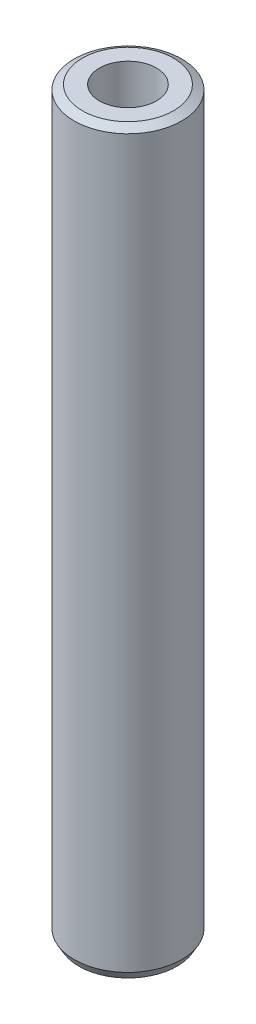
ISO-10303-21;
HEADER;
FILE_DESCRIPTION(('STEP AP214'),'2;1');
FILE_NAME('part.step','',(''),(''),'','','');
FILE_SCHEMA(('AUTOMOTIVE_DESIGN { 1 0 10303 214 1 1 1 1 }'));
ENDSEC;
DATA;
#1=APPLICATION_CONTEXT('core data for automotive mechanical design processes');
#2=APPLICATION_PROTOCOL_DEFINITION('international standard','automotive_design',2000,#1);
#3=PRODUCT_CONTEXT('',#1,'mechanical');
#4=PRODUCT('Part','Part','',(#3));
#5=PRODUCT_RELATED_PRODUCT_CATEGORY('part','',(#4));
#6=PRODUCT_DEFINITION_FORMATION('','',#4);
#7=PRODUCT_DEFINITION_CONTEXT('part definition',#1,'design');
#8=PRODUCT_DEFINITION('design','',#6,#7);
#9=PRODUCT_DEFINITION_SHAPE('','',#8);
#10=(LENGTH_UNIT() NAMED_UNIT(*) SI_UNIT(.MILLI.,.METRE.));
#11=(NAMED_UNIT(*) PLANE_ANGLE_UNIT() SI_UNIT($,.RADIAN.));
#12=(NAMED_UNIT(*) SI_UNIT($,.STERADIAN.) SOLID_ANGLE_UNIT());
#13=UNCERTAINTY_MEASURE_WITH_UNIT(LENGTH_MEASURE(1.E-05),#10,'distance_accuracy_value','');
#14=(GEOMETRIC_REPRESENTATION_CONTEXT(3) GLOBAL_UNCERTAINTY_ASSIGNED_CONTEXT((#13)) GLOBAL_UNIT_ASSIGNED_CONTEXT((#10,
#11,#12)) REPRESENTATION_CONTEXT('',''));
#15=CARTESIAN_POINT('',(0.,0.,0.));
#16=DIRECTION('',(0.,0.,1.));
#17=DIRECTION('',(1.,0.,0.));
#18=AXIS2_PLACEMENT_3D('',#15,#16,#17);
#19=CARTESIAN_POINT('',(0.,68.7097333665572,0.));
#20=DIRECTION('',(0.,-1.,0.));
#21=DIRECTION('',(0.,0.,-1.));
#22=AXIS2_PLACEMENT_3D('',#19,#20,#21);
#23=CYLINDRICAL_SURFACE('',#22,5.);
#24=CARTESIAN_POINT('',(0.,68.2704359042295,0.));
#25=DIRECTION('',(0.,1.,0.));
#26=DIRECTION('',(0.,0.,1.));
#27=AXIS2_PLACEMENT_3D('',#24,#25,#26);
#28=CIRCLE('',#27,5.);
#29=CARTESIAN_POINT('',(0.,68.2704359042295,5.));
#30=VERTEX_POINT('',#29);
#31=EDGE_CURVE('E50',#30,#30,#28,.F.);
#32=ORIENTED_EDGE('',*,*,#31,.T.);
#33=EDGE_LOOP('',(#32));
#34=FACE_BOUND('',#33,.T.);
#35=CARTESIAN_POINT('',(0.,0.760885524387536,0.));
#36=DIRECTION('',(0.,1.,0.));
#37=DIRECTION('',(0.,0.,1.));
#38=AXIS2_PLACEMENT_3D('',#35,#36,#37);
#39=CIRCLE('',#38,5.);
#40=CARTESIAN_POINT('',(0.,0.760885524387536,5.));
#41=VERTEX_POINT('',#40);
#42=EDGE_CURVE('E51',#41,#41,#39,.T.);
#43=ORIENTED_EDGE('',*,*,#42,.T.);
#44=EDGE_LOOP('',(#43));
#45=FACE_BOUND('',#44,.T.);
#46=ADVANCED_FACE('F39',(#34,#45),#23,.T.);
#47=CARTESIAN_POINT('',(0.,68.7097333665572,0.));
#48=DIRECTION('',(0.,1.,0.));
#49=DIRECTION('',(0.,0.,1.));
#50=AXIS2_PLACEMENT_3D('',#47,#48,#49);
#51=PLANE('',#50);
#52=CARTESIAN_POINT('',(0.,68.7097333665572,0.));
#53=DIRECTION('',(0.,1.,0.));
#54=DIRECTION('',(0.,0.,1.));
#55=AXIS2_PLACEMENT_3D('',#52,#53,#54);
#56=CIRCLE('',#55,4.23911447561244);
#57=CARTESIAN_POINT('',(0.,68.7097333665572,4.23911447561244));
#58=VERTEX_POINT('',#57);
#59=EDGE_CURVE('E54',#58,#58,#56,.T.);
#60=ORIENTED_EDGE('',*,*,#59,.T.);
#61=EDGE_LOOP('',(#60));
#62=FACE_BOUND('',#61,.T.);
#63=CARTESIAN_POINT('',(0.,68.7097333665572,0.));
#64=DIRECTION('',(0.,1.,0.));
#65=DIRECTION('',(0.,0.,1.));
#66=AXIS2_PLACEMENT_3D('',#63,#64,#65);
#67=CIRCLE('',#66,2.65166426847905);
#68=CARTESIAN_POINT('',(0.,68.7097333665572,2.65166426847905));
#69=VERTEX_POINT('',#68);
#70=EDGE_CURVE('E58',#69,#69,#67,.T.);
#71=ORIENTED_EDGE('',*,*,#70,.F.);
#72=EDGE_LOOP('',(#71));
#73=FACE_BOUND('',#72,.T.);
#74=ADVANCED_FACE('F69',(#62,#73),#51,.T.);
#75=CARTESIAN_POINT('',(0.,0.,0.));
#76=DIRECTION('',(0.,1.,0.));
#77=DIRECTION('',(0.,0.,1.));
#78=AXIS2_PLACEMENT_3D('',#75,#76,#77);
#79=PLANE('',#78);
#80=CARTESIAN_POINT('',(0.,0.,0.));
#81=DIRECTION('',(0.,1.,0.));
#82=DIRECTION('',(0.,0.,1.));
#83=AXIS2_PLACEMENT_3D('',#80,#81,#82);
#84=CIRCLE('',#83,4.56070253767236);
#85=CARTESIAN_POINT('',(0.,0.,4.56070253767236));
#86=VERTEX_POINT('',#85);
#87=EDGE_CURVE('E10',#86,#86,#84,.F.);
#88=ORIENTED_EDGE('',*,*,#87,.T.);
#89=EDGE_LOOP('',(#88));
#90=FACE_BOUND('',#89,.T.);
#91=CARTESIAN_POINT('',(0.,0.,0.));
#92=DIRECTION('',(0.,1.,0.));
#93=DIRECTION('',(0.,0.,1.));
#94=AXIS2_PLACEMENT_3D('',#91,#92,#93);
#95=CIRCLE('',#94,2.65166426847905);
#96=CARTESIAN_POINT('',(0.,0.,2.65166426847905));
#97=VERTEX_POINT('',#96);
#98=EDGE_CURVE('E63',#97,#97,#95,.T.);
#99=ORIENTED_EDGE('',*,*,#98,.T.);
#100=EDGE_LOOP('',(#99));
#101=FACE_BOUND('',#100,.T.);
#102=ADVANCED_FACE('F75',(#90,#101),#79,.F.);
#103=CARTESIAN_POINT('',(0.,68.7097333665572,0.));
#104=DIRECTION('',(0.,-1.,0.));
#105=DIRECTION('',(0.,0.,-1.));
#106=AXIS2_PLACEMENT_3D('',#103,#104,#105);
#107=CYLINDRICAL_SURFACE('',#106,2.65166426847905);
#108=ORIENTED_EDGE('',*,*,#70,.T.);
#109=EDGE_LOOP('',(#108));
#110=FACE_BOUND('',#109,.T.);
#111=ORIENTED_EDGE('',*,*,#98,.F.);
#112=EDGE_LOOP('',(#111));
#113=FACE_BOUND('',#112,.T.);
#114=ADVANCED_FACE('F70',(#110,#113),#107,.F.);
#115=CARTESIAN_POINT('',(0.,68.7097333665572,0.));
#116=DIRECTION('',(0.,-1.,0.));
#117=DIRECTION('',(0.,0.,-1.));
#118=AXIS2_PLACEMENT_3D('',#115,#116,#117);
#119=CONICAL_SURFACE('',#118,4.23911447561244,1.04719755119659);
#120=ORIENTED_EDGE('',*,*,#31,.F.);
#121=EDGE_LOOP('',(#120));
#122=FACE_BOUND('',#121,.T.);
#123=ORIENTED_EDGE('',*,*,#59,.F.);
#124=EDGE_LOOP('',(#123));
#125=FACE_BOUND('',#124,.T.);
#126=ADVANCED_FACE('F81',(#122,#125),#119,.T.);
#127=CARTESIAN_POINT('',(0.,0.760885524387536,0.));
#128=DIRECTION('',(0.,1.,0.));
#129=DIRECTION('',(0.,0.,1.));
#130=AXIS2_PLACEMENT_3D('',#127,#128,#129);
#131=CONICAL_SURFACE('',#130,5.,0.523598775598307);
#132=ORIENTED_EDGE('',*,*,#87,.F.);
#133=EDGE_LOOP('',(#132));
#134=FACE_BOUND('',#133,.T.);
#135=ORIENTED_EDGE('',*,*,#42,.F.);
#136=EDGE_LOOP('',(#135));
#137=FACE_BOUND('',#136,.T.);
#138=ADVANCED_FACE('F45',(#134,#137),#131,.T.);
#139=CLOSED_SHELL('',(#46,#74,#102,#114,#126,#138));
#140=MANIFOLD_SOLID_BREP('B2',#139);
#141=ADVANCED_BREP_SHAPE_REPRESENTATION('',(#18,#140),#14);
#142=SHAPE_DEFINITION_REPRESENTATION(#9,#141);
ENDSEC;
END-ISO-10303-21;
